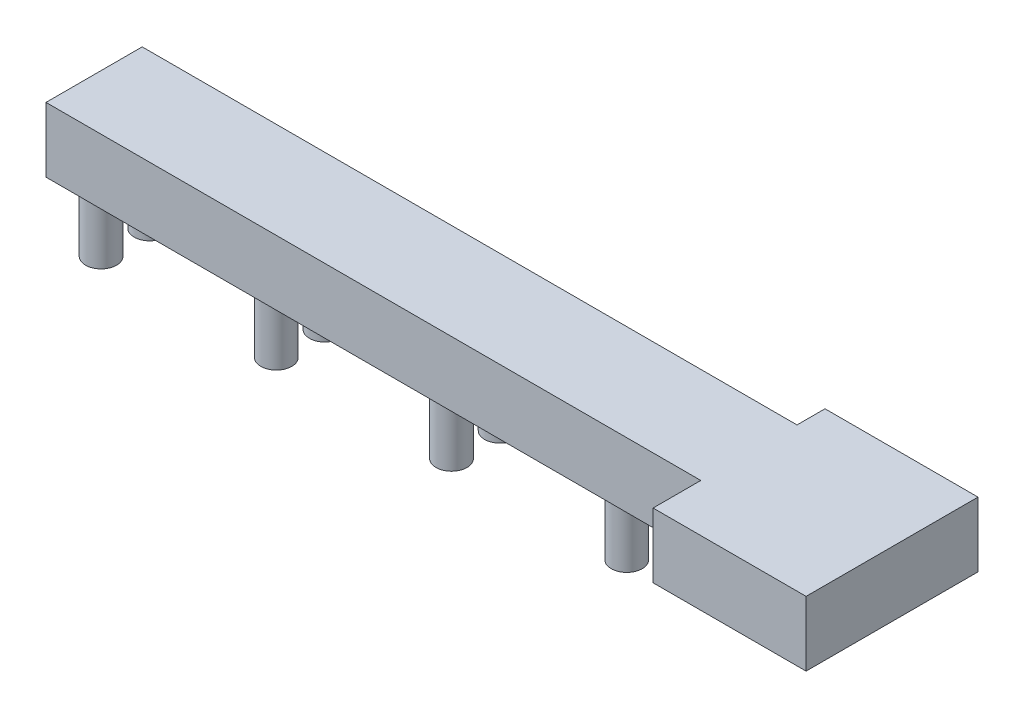
ISO-10303-21;
HEADER;
FILE_DESCRIPTION(('STEP AP214'),'2;1');
FILE_NAME('part.step','',(''),(''),'','','');
FILE_SCHEMA(('AUTOMOTIVE_DESIGN { 1 0 10303 214 1 1 1 1 }'));
ENDSEC;
DATA;
#1=APPLICATION_CONTEXT('core data for automotive mechanical design processes');
#2=APPLICATION_PROTOCOL_DEFINITION('international standard','automotive_design',2000,#1);
#3=PRODUCT_CONTEXT('',#1,'mechanical');
#4=PRODUCT('Part','Part','',(#3));
#5=PRODUCT_RELATED_PRODUCT_CATEGORY('part','',(#4));
#6=PRODUCT_DEFINITION_FORMATION('','',#4);
#7=PRODUCT_DEFINITION_CONTEXT('part definition',#1,'design');
#8=PRODUCT_DEFINITION('design','',#6,#7);
#9=PRODUCT_DEFINITION_SHAPE('','',#8);
#10=(LENGTH_UNIT() NAMED_UNIT(*) SI_UNIT(.MILLI.,.METRE.));
#11=(NAMED_UNIT(*) PLANE_ANGLE_UNIT() SI_UNIT($,.RADIAN.));
#12=(NAMED_UNIT(*) SI_UNIT($,.STERADIAN.) SOLID_ANGLE_UNIT());
#13=UNCERTAINTY_MEASURE_WITH_UNIT(LENGTH_MEASURE(1.E-05),#10,'distance_accuracy_value','');
#14=(GEOMETRIC_REPRESENTATION_CONTEXT(3) GLOBAL_UNCERTAINTY_ASSIGNED_CONTEXT((#13)) GLOBAL_UNIT_ASSIGNED_CONTEXT((#10,
#11,#12)) REPRESENTATION_CONTEXT('',''));
#15=CARTESIAN_POINT('',(0.,0.,0.));
#16=DIRECTION('',(0.,0.,1.));
#17=DIRECTION('',(1.,0.,0.));
#18=AXIS2_PLACEMENT_3D('',#15,#16,#17);
#19=CARTESIAN_POINT('',(12.3863090129927,10.,7.35));
#20=DIRECTION('',(0.,0.,-1.));
#21=DIRECTION('',(-1.,0.,0.));
#22=AXIS2_PLACEMENT_3D('',#19,#20,#21);
#23=PLANE('',#22);
#24=DIRECTION('',(1.,0.,0.));
#25=VECTOR('',#24,1.);
#26=CARTESIAN_POINT('',(12.3863090129927,0.,7.35));
#27=LINE('',#26,#25);
#28=CARTESIAN_POINT('',(-88.7036909870073,0.,7.35));
#29=VERTEX_POINT('',#28);
#30=CARTESIAN_POINT('',(12.3863090129927,0.,7.35));
#31=VERTEX_POINT('',#30);
#32=EDGE_CURVE('E134',#29,#31,#27,.T.);
#33=ORIENTED_EDGE('',*,*,#32,.T.);
#34=DIRECTION('',(0.,-1.,0.));
#35=VECTOR('',#34,1.);
#36=CARTESIAN_POINT('',(12.3863090129927,10.,7.35));
#37=LINE('',#36,#35);
#38=CARTESIAN_POINT('',(12.3863090129927,10.,7.35));
#39=VERTEX_POINT('',#38);
#40=EDGE_CURVE('E159',#39,#31,#37,.T.);
#41=ORIENTED_EDGE('',*,*,#40,.F.);
#42=DIRECTION('',(1.,0.,0.));
#43=VECTOR('',#42,1.);
#44=CARTESIAN_POINT('',(12.3863090129927,10.,7.35));
#45=LINE('',#44,#43);
#46=CARTESIAN_POINT('',(-88.7036909870073,10.,7.35));
#47=VERTEX_POINT('',#46);
#48=EDGE_CURVE('E94',#47,#39,#45,.T.);
#49=ORIENTED_EDGE('',*,*,#48,.F.);
#50=DIRECTION('',(0.,-1.,0.));
#51=VECTOR('',#50,1.);
#52=CARTESIAN_POINT('',(-88.7036909870073,10.,7.35));
#53=LINE('',#52,#51);
#54=EDGE_CURVE('E162',#47,#29,#53,.T.);
#55=ORIENTED_EDGE('',*,*,#54,.T.);
#56=EDGE_LOOP('',(#33,#41,#49,#55));
#57=FACE_BOUND('',#56,.T.);
#58=ADVANCED_FACE('F34',(#57),#23,.F.);
#59=CARTESIAN_POINT('',(12.3863090129927,10.,14.72));
#60=DIRECTION('',(1.,0.,0.));
#61=DIRECTION('',(0.,0.,-1.));
#62=AXIS2_PLACEMENT_3D('',#59,#60,#61);
#63=PLANE('',#62);
#64=DIRECTION('',(0.,0.,1.));
#65=VECTOR('',#64,1.);
#66=CARTESIAN_POINT('',(12.3863090129927,0.,14.72));
#67=LINE('',#66,#65);
#68=CARTESIAN_POINT('',(12.3863090129927,0.,14.72));
#69=VERTEX_POINT('',#68);
#70=EDGE_CURVE('E136',#31,#69,#67,.T.);
#71=ORIENTED_EDGE('',*,*,#70,.T.);
#72=DIRECTION('',(0.,-1.,0.));
#73=VECTOR('',#72,1.);
#74=CARTESIAN_POINT('',(12.3863090129927,10.,14.72));
#75=LINE('',#74,#73);
#76=CARTESIAN_POINT('',(12.3863090129927,10.,14.72));
#77=VERTEX_POINT('',#76);
#78=EDGE_CURVE('E156',#77,#69,#75,.T.);
#79=ORIENTED_EDGE('',*,*,#78,.F.);
#80=DIRECTION('',(0.,0.,1.));
#81=VECTOR('',#80,1.);
#82=CARTESIAN_POINT('',(12.3863090129927,10.,14.72));
#83=LINE('',#82,#81);
#84=EDGE_CURVE('E414',#39,#77,#83,.T.);
#85=ORIENTED_EDGE('',*,*,#84,.F.);
#86=ORIENTED_EDGE('',*,*,#40,.T.);
#87=EDGE_LOOP('',(#71,#79,#85,#86));
#88=FACE_BOUND('',#87,.T.);
#89=ADVANCED_FACE('F204',(#88),#63,.F.);
#90=CARTESIAN_POINT('',(36.0063090129927,10.,14.72));
#91=DIRECTION('',(0.,0.,-1.));
#92=DIRECTION('',(-1.,0.,0.));
#93=AXIS2_PLACEMENT_3D('',#90,#91,#92);
#94=PLANE('',#93);
#95=DIRECTION('',(1.,0.,0.));
#96=VECTOR('',#95,1.);
#97=CARTESIAN_POINT('',(36.0063090129927,0.,14.72));
#98=LINE('',#97,#96);
#99=CARTESIAN_POINT('',(36.0063090129927,0.,14.72));
#100=VERTEX_POINT('',#99);
#101=EDGE_CURVE('E139',#69,#100,#98,.T.);
#102=ORIENTED_EDGE('',*,*,#101,.T.);
#103=DIRECTION('',(0.,-1.,0.));
#104=VECTOR('',#103,1.);
#105=CARTESIAN_POINT('',(36.0063090129927,10.,14.72));
#106=LINE('',#105,#104);
#107=CARTESIAN_POINT('',(36.0063090129927,10.,14.72));
#108=VERTEX_POINT('',#107);
#109=EDGE_CURVE('E153',#108,#100,#106,.T.);
#110=ORIENTED_EDGE('',*,*,#109,.F.);
#111=DIRECTION('',(1.,0.,0.));
#112=VECTOR('',#111,1.);
#113=CARTESIAN_POINT('',(36.0063090129927,10.,14.72));
#114=LINE('',#113,#112);
#115=EDGE_CURVE('E415',#77,#108,#114,.T.);
#116=ORIENTED_EDGE('',*,*,#115,.F.);
#117=ORIENTED_EDGE('',*,*,#78,.T.);
#118=EDGE_LOOP('',(#102,#110,#116,#117));
#119=FACE_BOUND('',#118,.T.);
#120=ADVANCED_FACE('F209',(#119),#94,.F.);
#121=CARTESIAN_POINT('',(36.0063090129927,10.,-11.82));
#122=DIRECTION('',(-1.,0.,0.));
#123=DIRECTION('',(0.,0.,1.));
#124=AXIS2_PLACEMENT_3D('',#121,#122,#123);
#125=PLANE('',#124);
#126=DIRECTION('',(0.,0.,-1.));
#127=VECTOR('',#126,1.);
#128=CARTESIAN_POINT('',(36.0063090129927,0.,-11.82));
#129=LINE('',#128,#127);
#130=CARTESIAN_POINT('',(36.0063090129927,0.,-11.82));
#131=VERTEX_POINT('',#130);
#132=EDGE_CURVE('E141',#100,#131,#129,.T.);
#133=ORIENTED_EDGE('',*,*,#132,.T.);
#134=DIRECTION('',(0.,-1.,0.));
#135=VECTOR('',#134,1.);
#136=CARTESIAN_POINT('',(36.0063090129927,10.,-11.82));
#137=LINE('',#136,#135);
#138=CARTESIAN_POINT('',(36.0063090129927,10.,-11.82));
#139=VERTEX_POINT('',#138);
#140=EDGE_CURVE('E125',#139,#131,#137,.T.);
#141=ORIENTED_EDGE('',*,*,#140,.F.);
#142=DIRECTION('',(0.,0.,-1.));
#143=VECTOR('',#142,1.);
#144=CARTESIAN_POINT('',(36.0063090129927,10.,-11.82));
#145=LINE('',#144,#143);
#146=EDGE_CURVE('E114',#108,#139,#145,.T.);
#147=ORIENTED_EDGE('',*,*,#146,.F.);
#148=ORIENTED_EDGE('',*,*,#109,.T.);
#149=EDGE_LOOP('',(#133,#141,#147,#148));
#150=FACE_BOUND('',#149,.T.);
#151=ADVANCED_FACE('F373',(#150),#125,.F.);
#152=CARTESIAN_POINT('',(12.3863090129927,10.,-11.82));
#153=DIRECTION('',(0.,0.,1.));
#154=DIRECTION('',(1.,0.,0.));
#155=AXIS2_PLACEMENT_3D('',#152,#153,#154);
#156=PLANE('',#155);
#157=DIRECTION('',(-1.,0.,0.));
#158=VECTOR('',#157,1.);
#159=CARTESIAN_POINT('',(12.3863090129927,0.,-11.82));
#160=LINE('',#159,#158);
#161=CARTESIAN_POINT('',(12.3863090129927,0.,-11.82));
#162=VERTEX_POINT('',#161);
#163=EDGE_CURVE('E123',#131,#162,#160,.T.);
#164=ORIENTED_EDGE('',*,*,#163,.T.);
#165=DIRECTION('',(0.,-1.,0.));
#166=VECTOR('',#165,1.);
#167=CARTESIAN_POINT('',(12.3863090129927,10.,-11.82));
#168=LINE('',#167,#166);
#169=CARTESIAN_POINT('',(12.3863090129927,10.,-11.82));
#170=VERTEX_POINT('',#169);
#171=EDGE_CURVE('E120',#170,#162,#168,.T.);
#172=ORIENTED_EDGE('',*,*,#171,.F.);
#173=DIRECTION('',(-1.,0.,0.));
#174=VECTOR('',#173,1.);
#175=CARTESIAN_POINT('',(12.3863090129927,10.,-11.82));
#176=LINE('',#175,#174);
#177=EDGE_CURVE('E107',#139,#170,#176,.T.);
#178=ORIENTED_EDGE('',*,*,#177,.F.);
#179=ORIENTED_EDGE('',*,*,#140,.T.);
#180=EDGE_LOOP('',(#164,#172,#178,#179));
#181=FACE_BOUND('',#180,.T.);
#182=ADVANCED_FACE('F121',(#181),#156,.F.);
#183=CARTESIAN_POINT('',(12.3863090129927,10.,-7.5));
#184=DIRECTION('',(1.,0.,0.));
#185=DIRECTION('',(0.,0.,-1.));
#186=AXIS2_PLACEMENT_3D('',#183,#184,#185);
#187=PLANE('',#186);
#188=DIRECTION('',(0.,0.,1.));
#189=VECTOR('',#188,1.);
#190=CARTESIAN_POINT('',(12.3863090129927,0.,-7.5));
#191=LINE('',#190,#189);
#192=CARTESIAN_POINT('',(12.3863090129927,0.,-7.5));
#193=VERTEX_POINT('',#192);
#194=EDGE_CURVE('E144',#162,#193,#191,.T.);
#195=ORIENTED_EDGE('',*,*,#194,.T.);
#196=DIRECTION('',(0.,-1.,0.));
#197=VECTOR('',#196,1.);
#198=CARTESIAN_POINT('',(12.3863090129927,10.,-7.5));
#199=LINE('',#198,#197);
#200=CARTESIAN_POINT('',(12.3863090129927,10.,-7.5));
#201=VERTEX_POINT('',#200);
#202=EDGE_CURVE('E126',#201,#193,#199,.T.);
#203=ORIENTED_EDGE('',*,*,#202,.F.);
#204=DIRECTION('',(0.,0.,1.));
#205=VECTOR('',#204,1.);
#206=CARTESIAN_POINT('',(12.3863090129927,10.,-7.5));
#207=LINE('',#206,#205);
#208=EDGE_CURVE('E111',#170,#201,#207,.T.);
#209=ORIENTED_EDGE('',*,*,#208,.F.);
#210=ORIENTED_EDGE('',*,*,#171,.T.);
#211=EDGE_LOOP('',(#195,#203,#209,#210));
#212=FACE_BOUND('',#211,.T.);
#213=ADVANCED_FACE('F128',(#212),#187,.F.);
#214=CARTESIAN_POINT('',(-88.7036909870073,10.,-7.5));
#215=DIRECTION('',(0.,0.,1.));
#216=DIRECTION('',(1.,0.,0.));
#217=AXIS2_PLACEMENT_3D('',#214,#215,#216);
#218=PLANE('',#217);
#219=DIRECTION('',(-1.,0.,0.));
#220=VECTOR('',#219,1.);
#221=CARTESIAN_POINT('',(-88.7036909870073,0.,-7.5));
#222=LINE('',#221,#220);
#223=CARTESIAN_POINT('',(-88.7036909870073,0.,-7.5));
#224=VERTEX_POINT('',#223);
#225=EDGE_CURVE('E80',#193,#224,#222,.T.);
#226=ORIENTED_EDGE('',*,*,#225,.T.);
#227=DIRECTION('',(0.,-1.,0.));
#228=VECTOR('',#227,1.);
#229=CARTESIAN_POINT('',(-88.7036909870073,10.,-7.5));
#230=LINE('',#229,#228);
#231=CARTESIAN_POINT('',(-88.7036909870073,10.,-7.5));
#232=VERTEX_POINT('',#231);
#233=EDGE_CURVE('E130',#232,#224,#230,.T.);
#234=ORIENTED_EDGE('',*,*,#233,.F.);
#235=DIRECTION('',(-1.,0.,0.));
#236=VECTOR('',#235,1.);
#237=CARTESIAN_POINT('',(-2.7236909870073,10.,-7.5));
#238=LINE('',#237,#236);
#239=EDGE_CURVE('E51',#201,#232,#238,.T.);
#240=ORIENTED_EDGE('',*,*,#239,.F.);
#241=ORIENTED_EDGE('',*,*,#202,.T.);
#242=EDGE_LOOP('',(#226,#234,#240,#241));
#243=FACE_BOUND('',#242,.T.);
#244=ADVANCED_FACE('F345',(#243),#218,.F.);
#245=CARTESIAN_POINT('',(-88.7036909870073,10.,0.));
#246=DIRECTION('',(1.,0.,0.));
#247=DIRECTION('',(0.,0.,-1.));
#248=AXIS2_PLACEMENT_3D('',#245,#246,#247);
#249=PLANE('',#248);
#250=DIRECTION('',(0.,0.,1.));
#251=VECTOR('',#250,1.);
#252=CARTESIAN_POINT('',(-88.7036909870073,0.,0.));
#253=LINE('',#252,#251);
#254=EDGE_CURVE('E147',#224,#29,#253,.T.);
#255=ORIENTED_EDGE('',*,*,#254,.T.);
#256=ORIENTED_EDGE('',*,*,#54,.F.);
#257=DIRECTION('',(0.,0.,1.));
#258=VECTOR('',#257,1.);
#259=CARTESIAN_POINT('',(-88.7036909870073,10.,7.35));
#260=LINE('',#259,#258);
#261=EDGE_CURVE('E149',#232,#47,#260,.T.);
#262=ORIENTED_EDGE('',*,*,#261,.F.);
#263=ORIENTED_EDGE('',*,*,#233,.T.);
#264=EDGE_LOOP('',(#255,#256,#262,#263));
#265=FACE_BOUND('',#264,.T.);
#266=ADVANCED_FACE('F198',(#265),#249,.F.);
#267=CARTESIAN_POINT('',(0.,10.,0.));
#268=DIRECTION('',(0.,-1.,0.));
#269=DIRECTION('',(0.,0.,-1.));
#270=AXIS2_PLACEMENT_3D('',#267,#268,#269);
#271=PLANE('',#270);
#272=ORIENTED_EDGE('',*,*,#261,.T.);
#273=ORIENTED_EDGE('',*,*,#48,.T.);
#274=ORIENTED_EDGE('',*,*,#84,.T.);
#275=ORIENTED_EDGE('',*,*,#115,.T.);
#276=ORIENTED_EDGE('',*,*,#146,.T.);
#277=ORIENTED_EDGE('',*,*,#177,.T.);
#278=ORIENTED_EDGE('',*,*,#208,.T.);
#279=ORIENTED_EDGE('',*,*,#239,.T.);
#280=EDGE_LOOP('',(#272,#273,#274,#275,#276,#277,#278,#279));
#281=FACE_BOUND('',#280,.T.);
#282=ADVANCED_FACE('F109',(#281),#271,.F.);
#283=CARTESIAN_POINT('',(0.,0.,0.));
#284=DIRECTION('',(0.,-1.,0.));
#285=DIRECTION('',(0.,0.,-1.));
#286=AXIS2_PLACEMENT_3D('',#283,#284,#285);
#287=PLANE('',#286);
#288=CARTESIAN_POINT('',(-56.8236909870073,0.,-3.825));
#289=DIRECTION('',(0.,-1.,0.));
#290=DIRECTION('',(0.,0.,-1.));
#291=AXIS2_PLACEMENT_3D('',#288,#289,#290);
#292=CIRCLE('',#291,2.39);
#293=CARTESIAN_POINT('',(-56.8236909870073,0.,-6.215));
#294=VERTEX_POINT('',#293);
#295=EDGE_CURVE('E441',#294,#294,#292,.T.);
#296=ORIENTED_EDGE('',*,*,#295,.F.);
#297=EDGE_LOOP('',(#296));
#298=FACE_BOUND('',#297,.T.);
#299=CARTESIAN_POINT('',(-56.8236909870073,0.,3.675));
#300=DIRECTION('',(0.,-1.,0.));
#301=DIRECTION('',(0.,0.,-1.));
#302=AXIS2_PLACEMENT_3D('',#299,#300,#301);
#303=CIRCLE('',#302,2.39294525089885);
#304=CARTESIAN_POINT('',(-56.8236909870073,0.,1.28205474910115));
#305=VERTEX_POINT('',#304);
#306=EDGE_CURVE('E435',#305,#305,#303,.T.);
#307=ORIENTED_EDGE('',*,*,#306,.F.);
#308=EDGE_LOOP('',(#307));
#309=FACE_BOUND('',#308,.T.);
#310=CARTESIAN_POINT('',(-83.8736909870073,0.,3.675));
#311=DIRECTION('',(0.,-1.,0.));
#312=DIRECTION('',(0.,0.,-1.));
#313=AXIS2_PLACEMENT_3D('',#310,#311,#312);
#314=CIRCLE('',#313,2.39294525089885);
#315=CARTESIAN_POINT('',(-83.8736909870073,0.,1.28205474910115));
#316=VERTEX_POINT('',#315);
#317=EDGE_CURVE('E427',#316,#316,#314,.T.);
#318=ORIENTED_EDGE('',*,*,#317,.F.);
#319=EDGE_LOOP('',(#318));
#320=FACE_BOUND('',#319,.T.);
#321=CARTESIAN_POINT('',(-83.8736909870073,0.,-3.825));
#322=DIRECTION('',(0.,-1.,0.));
#323=DIRECTION('',(0.,0.,-1.));
#324=AXIS2_PLACEMENT_3D('',#321,#322,#323);
#325=CIRCLE('',#324,2.39);
#326=CARTESIAN_POINT('',(-83.8736909870073,0.,-6.215));
#327=VERTEX_POINT('',#326);
#328=EDGE_CURVE('E421',#327,#327,#325,.T.);
#329=ORIENTED_EDGE('',*,*,#328,.F.);
#330=EDGE_LOOP('',(#329));
#331=FACE_BOUND('',#330,.T.);
#332=ORIENTED_EDGE('',*,*,#32,.F.);
#333=ORIENTED_EDGE('',*,*,#254,.F.);
#334=ORIENTED_EDGE('',*,*,#225,.F.);
#335=ORIENTED_EDGE('',*,*,#194,.F.);
#336=ORIENTED_EDGE('',*,*,#163,.F.);
#337=ORIENTED_EDGE('',*,*,#132,.F.);
#338=ORIENTED_EDGE('',*,*,#101,.F.);
#339=ORIENTED_EDGE('',*,*,#70,.F.);
#340=EDGE_LOOP('',(#332,#333,#334,#335,#336,#337,#338,#339));
#341=FACE_BOUND('',#340,.T.);
#342=CARTESIAN_POINT('',(-29.7736909870073,0.,3.675));
#343=DIRECTION('',(0.,-1.,0.));
#344=DIRECTION('',(0.,0.,-1.));
#345=AXIS2_PLACEMENT_3D('',#342,#343,#344);
#346=CIRCLE('',#345,2.39294525089885);
#347=CARTESIAN_POINT('',(-29.7736909870073,0.,1.28205474910115));
#348=VERTEX_POINT('',#347);
#349=EDGE_CURVE('E164',#348,#348,#346,.T.);
#350=ORIENTED_EDGE('',*,*,#349,.F.);
#351=EDGE_LOOP('',(#350));
#352=FACE_BOUND('',#351,.T.);
#353=CARTESIAN_POINT('',(-2.72369098700731,0.,3.675));
#354=DIRECTION('',(0.,-1.,0.));
#355=DIRECTION('',(0.,0.,-1.));
#356=AXIS2_PLACEMENT_3D('',#353,#354,#355);
#357=CIRCLE('',#356,2.39294525089885);
#358=CARTESIAN_POINT('',(-2.72369098700731,0.,1.28205474910115));
#359=VERTEX_POINT('',#358);
#360=EDGE_CURVE('E170',#359,#359,#357,.T.);
#361=ORIENTED_EDGE('',*,*,#360,.F.);
#362=EDGE_LOOP('',(#361));
#363=FACE_BOUND('',#362,.T.);
#364=CARTESIAN_POINT('',(-29.7736909870073,0.,-3.825));
#365=DIRECTION('',(0.,-1.,0.));
#366=DIRECTION('',(0.,0.,-1.));
#367=AXIS2_PLACEMENT_3D('',#364,#365,#366);
#368=CIRCLE('',#367,2.39);
#369=CARTESIAN_POINT('',(-29.7736909870073,0.,-6.215));
#370=VERTEX_POINT('',#369);
#371=EDGE_CURVE('E176',#370,#370,#368,.T.);
#372=ORIENTED_EDGE('',*,*,#371,.F.);
#373=EDGE_LOOP('',(#372));
#374=FACE_BOUND('',#373,.T.);
#375=CARTESIAN_POINT('',(-2.72369098700731,0.,-3.825));
#376=DIRECTION('',(0.,-1.,0.));
#377=DIRECTION('',(0.,0.,-1.));
#378=AXIS2_PLACEMENT_3D('',#375,#376,#377);
#379=CIRCLE('',#378,2.39);
#380=CARTESIAN_POINT('',(-2.72369098700731,0.,-6.215));
#381=VERTEX_POINT('',#380);
#382=EDGE_CURVE('E43',#381,#381,#379,.T.);
#383=ORIENTED_EDGE('',*,*,#382,.F.);
#384=EDGE_LOOP('',(#383));
#385=FACE_BOUND('',#384,.T.);
#386=ADVANCED_FACE('F186',(#298,#309,#320,#331,#341,#352,#363,#374,#385),#287,.T.);
#387=CARTESIAN_POINT('',(-83.8736909870073,-10.,-3.825));
#388=DIRECTION('',(0.,1.,0.));
#389=DIRECTION('',(0.,0.,1.));
#390=AXIS2_PLACEMENT_3D('',#387,#388,#389);
#391=CYLINDRICAL_SURFACE('',#390,2.39);
#392=CARTESIAN_POINT('',(-83.8736909870073,-10.,-3.825));
#393=DIRECTION('',(0.,-1.,0.));
#394=DIRECTION('',(0.,0.,-1.));
#395=AXIS2_PLACEMENT_3D('',#392,#393,#394);
#396=CIRCLE('',#395,2.39);
#397=CARTESIAN_POINT('',(-83.8736909870073,-10.,-6.215));
#398=VERTEX_POINT('',#397);
#399=EDGE_CURVE('E137',#398,#398,#396,.T.);
#400=ORIENTED_EDGE('',*,*,#399,.F.);
#401=EDGE_LOOP('',(#400));
#402=FACE_BOUND('',#401,.T.);
#403=ORIENTED_EDGE('',*,*,#328,.T.);
#404=EDGE_LOOP('',(#403));
#405=FACE_BOUND('',#404,.T.);
#406=ADVANCED_FACE('F188',(#402,#405),#391,.T.);
#407=CARTESIAN_POINT('',(-83.8736909870073,-10.,-3.825));
#408=DIRECTION('',(0.,-1.,0.));
#409=DIRECTION('',(0.,0.,-1.));
#410=AXIS2_PLACEMENT_3D('',#407,#408,#409);
#411=PLANE('',#410);
#412=ORIENTED_EDGE('',*,*,#399,.T.);
#413=EDGE_LOOP('',(#412));
#414=FACE_BOUND('',#413,.T.);
#415=ADVANCED_FACE('F195',(#414),#411,.T.);
#416=CARTESIAN_POINT('',(-83.8736909870073,-10.,3.675));
#417=DIRECTION('',(0.,1.,0.));
#418=DIRECTION('',(0.,0.,1.));
#419=AXIS2_PLACEMENT_3D('',#416,#417,#418);
#420=CYLINDRICAL_SURFACE('',#419,2.39294525089885);
#421=CARTESIAN_POINT('',(-83.8736909870073,-10.,3.675));
#422=DIRECTION('',(0.,-1.,0.));
#423=DIRECTION('',(0.,0.,-1.));
#424=AXIS2_PLACEMENT_3D('',#421,#422,#423);
#425=CIRCLE('',#424,2.39294525089885);
#426=CARTESIAN_POINT('',(-83.8736909870073,-10.,1.28205474910115));
#427=VERTEX_POINT('',#426);
#428=EDGE_CURVE('E424',#427,#427,#425,.T.);
#429=ORIENTED_EDGE('',*,*,#428,.F.);
#430=EDGE_LOOP('',(#429));
#431=FACE_BOUND('',#430,.T.);
#432=ORIENTED_EDGE('',*,*,#317,.T.);
#433=EDGE_LOOP('',(#432));
#434=FACE_BOUND('',#433,.T.);
#435=ADVANCED_FACE('F309',(#431,#434),#420,.T.);
#436=CARTESIAN_POINT('',(-83.8736909870073,-10.,3.675));
#437=DIRECTION('',(0.,-1.,0.));
#438=DIRECTION('',(0.,0.,-1.));
#439=AXIS2_PLACEMENT_3D('',#436,#437,#438);
#440=PLANE('',#439);
#441=ORIENTED_EDGE('',*,*,#428,.T.);
#442=EDGE_LOOP('',(#441));
#443=FACE_BOUND('',#442,.T.);
#444=ADVANCED_FACE('F301',(#443),#440,.T.);
#445=CARTESIAN_POINT('',(-56.8236909870073,-10.,3.675));
#446=DIRECTION('',(0.,1.,0.));
#447=DIRECTION('',(0.,0.,1.));
#448=AXIS2_PLACEMENT_3D('',#445,#446,#447);
#449=CYLINDRICAL_SURFACE('',#448,2.39294525089885);
#450=CARTESIAN_POINT('',(-56.8236909870073,-10.,3.675));
#451=DIRECTION('',(0.,-1.,0.));
#452=DIRECTION('',(0.,0.,-1.));
#453=AXIS2_PLACEMENT_3D('',#450,#451,#452);
#454=CIRCLE('',#453,2.39294525089885);
#455=CARTESIAN_POINT('',(-56.8236909870073,-10.,1.28205474910115));
#456=VERTEX_POINT('',#455);
#457=EDGE_CURVE('E430',#456,#456,#454,.T.);
#458=ORIENTED_EDGE('',*,*,#457,.F.);
#459=EDGE_LOOP('',(#458));
#460=FACE_BOUND('',#459,.T.);
#461=ORIENTED_EDGE('',*,*,#306,.T.);
#462=EDGE_LOOP('',(#461));
#463=FACE_BOUND('',#462,.T.);
#464=ADVANCED_FACE('F293',(#460,#463),#449,.T.);
#465=CARTESIAN_POINT('',(-56.8236909870073,-10.,3.675));
#466=DIRECTION('',(0.,-1.,0.));
#467=DIRECTION('',(0.,0.,-1.));
#468=AXIS2_PLACEMENT_3D('',#465,#466,#467);
#469=PLANE('',#468);
#470=ORIENTED_EDGE('',*,*,#457,.T.);
#471=EDGE_LOOP('',(#470));
#472=FACE_BOUND('',#471,.T.);
#473=ADVANCED_FACE('F222',(#472),#469,.T.);
#474=CARTESIAN_POINT('',(-29.7736909870073,-10.,3.675));
#475=DIRECTION('',(0.,-1.,0.));
#476=DIRECTION('',(0.,0.,-1.));
#477=AXIS2_PLACEMENT_3D('',#474,#475,#476);
#478=PLANE('',#477);
#479=CARTESIAN_POINT('',(-29.7736909870073,-10.,3.675));
#480=DIRECTION('',(0.,-1.,0.));
#481=DIRECTION('',(0.,0.,-1.));
#482=AXIS2_PLACEMENT_3D('',#479,#480,#481);
#483=CIRCLE('',#482,2.39294525089885);
#484=CARTESIAN_POINT('',(-29.7736909870073,-10.,1.28205474910115));
#485=VERTEX_POINT('',#484);
#486=EDGE_CURVE('E167',#485,#485,#483,.T.);
#487=ORIENTED_EDGE('',*,*,#486,.T.);
#488=EDGE_LOOP('',(#487));
#489=FACE_BOUND('',#488,.T.);
#490=ADVANCED_FACE('F218',(#489),#478,.T.);
#491=CARTESIAN_POINT('',(-29.7736909870073,-10.,3.675));
#492=DIRECTION('',(0.,1.,0.));
#493=DIRECTION('',(0.,0.,1.));
#494=AXIS2_PLACEMENT_3D('',#491,#492,#493);
#495=CYLINDRICAL_SURFACE('',#494,2.39294525089885);
#496=ORIENTED_EDGE('',*,*,#486,.F.);
#497=EDGE_LOOP('',(#496));
#498=FACE_BOUND('',#497,.T.);
#499=ORIENTED_EDGE('',*,*,#349,.T.);
#500=EDGE_LOOP('',(#499));
#501=FACE_BOUND('',#500,.T.);
#502=ADVANCED_FACE('F214',(#498,#501),#495,.T.);
#503=CARTESIAN_POINT('',(-2.72369098700731,-10.,3.675));
#504=DIRECTION('',(0.,-1.,0.));
#505=DIRECTION('',(0.,0.,-1.));
#506=AXIS2_PLACEMENT_3D('',#503,#504,#505);
#507=PLANE('',#506);
#508=CARTESIAN_POINT('',(-2.72369098700731,-10.,3.675));
#509=DIRECTION('',(0.,-1.,0.));
#510=DIRECTION('',(0.,0.,-1.));
#511=AXIS2_PLACEMENT_3D('',#508,#509,#510);
#512=CIRCLE('',#511,2.39294525089885);
#513=CARTESIAN_POINT('',(-2.72369098700731,-10.,1.28205474910115));
#514=VERTEX_POINT('',#513);
#515=EDGE_CURVE('E173',#514,#514,#512,.T.);
#516=ORIENTED_EDGE('',*,*,#515,.T.);
#517=EDGE_LOOP('',(#516));
#518=FACE_BOUND('',#517,.T.);
#519=ADVANCED_FACE('F217',(#518),#507,.T.);
#520=CARTESIAN_POINT('',(-2.72369098700731,-10.,3.675));
#521=DIRECTION('',(0.,1.,0.));
#522=DIRECTION('',(0.,0.,1.));
#523=AXIS2_PLACEMENT_3D('',#520,#521,#522);
#524=CYLINDRICAL_SURFACE('',#523,2.39294525089885);
#525=ORIENTED_EDGE('',*,*,#515,.F.);
#526=EDGE_LOOP('',(#525));
#527=FACE_BOUND('',#526,.T.);
#528=ORIENTED_EDGE('',*,*,#360,.T.);
#529=EDGE_LOOP('',(#528));
#530=FACE_BOUND('',#529,.T.);
#531=ADVANCED_FACE('F224',(#527,#530),#524,.T.);
#532=CARTESIAN_POINT('',(-56.8236909870073,-10.,-3.825));
#533=DIRECTION('',(0.,1.,0.));
#534=DIRECTION('',(0.,0.,1.));
#535=AXIS2_PLACEMENT_3D('',#532,#533,#534);
#536=CYLINDRICAL_SURFACE('',#535,2.39);
#537=CARTESIAN_POINT('',(-56.8236909870073,-10.,-3.825));
#538=DIRECTION('',(0.,-1.,0.));
#539=DIRECTION('',(0.,0.,-1.));
#540=AXIS2_PLACEMENT_3D('',#537,#538,#539);
#541=CIRCLE('',#540,2.39);
#542=CARTESIAN_POINT('',(-56.8236909870073,-10.,-6.215));
#543=VERTEX_POINT('',#542);
#544=EDGE_CURVE('E438',#543,#543,#541,.T.);
#545=ORIENTED_EDGE('',*,*,#544,.F.);
#546=EDGE_LOOP('',(#545));
#547=FACE_BOUND('',#546,.T.);
#548=ORIENTED_EDGE('',*,*,#295,.T.);
#549=EDGE_LOOP('',(#548));
#550=FACE_BOUND('',#549,.T.);
#551=ADVANCED_FACE('F227',(#547,#550),#536,.T.);
#552=CARTESIAN_POINT('',(-56.8236909870073,-10.,-3.825));
#553=DIRECTION('',(0.,-1.,0.));
#554=DIRECTION('',(0.,0.,-1.));
#555=AXIS2_PLACEMENT_3D('',#552,#553,#554);
#556=PLANE('',#555);
#557=ORIENTED_EDGE('',*,*,#544,.T.);
#558=EDGE_LOOP('',(#557));
#559=FACE_BOUND('',#558,.T.);
#560=ADVANCED_FACE('F238',(#559),#556,.T.);
#561=CARTESIAN_POINT('',(-29.7736909870073,-10.,-3.825));
#562=DIRECTION('',(0.,-1.,0.));
#563=DIRECTION('',(0.,0.,-1.));
#564=AXIS2_PLACEMENT_3D('',#561,#562,#563);
#565=PLANE('',#564);
#566=CARTESIAN_POINT('',(-29.7736909870073,-10.,-3.825));
#567=DIRECTION('',(0.,-1.,0.));
#568=DIRECTION('',(0.,0.,-1.));
#569=AXIS2_PLACEMENT_3D('',#566,#567,#568);
#570=CIRCLE('',#569,2.39);
#571=CARTESIAN_POINT('',(-29.7736909870073,-10.,-6.215));
#572=VERTEX_POINT('',#571);
#573=EDGE_CURVE('E179',#572,#572,#570,.T.);
#574=ORIENTED_EDGE('',*,*,#573,.T.);
#575=EDGE_LOOP('',(#574));
#576=FACE_BOUND('',#575,.T.);
#577=ADVANCED_FACE('F235',(#576),#565,.T.);
#578=CARTESIAN_POINT('',(-29.7736909870073,-10.,-3.825));
#579=DIRECTION('',(0.,1.,0.));
#580=DIRECTION('',(0.,0.,1.));
#581=AXIS2_PLACEMENT_3D('',#578,#579,#580);
#582=CYLINDRICAL_SURFACE('',#581,2.39);
#583=ORIENTED_EDGE('',*,*,#573,.F.);
#584=EDGE_LOOP('',(#583));
#585=FACE_BOUND('',#584,.T.);
#586=ORIENTED_EDGE('',*,*,#371,.T.);
#587=EDGE_LOOP('',(#586));
#588=FACE_BOUND('',#587,.T.);
#589=ADVANCED_FACE('F232',(#585,#588),#582,.T.);
#590=CARTESIAN_POINT('',(-2.72369098700731,-10.,-3.825));
#591=DIRECTION('',(0.,-1.,0.));
#592=DIRECTION('',(0.,0.,-1.));
#593=AXIS2_PLACEMENT_3D('',#590,#591,#592);
#594=PLANE('',#593);
#595=CARTESIAN_POINT('',(-2.72369098700731,-10.,-3.825));
#596=DIRECTION('',(0.,-1.,0.));
#597=DIRECTION('',(0.,0.,-1.));
#598=AXIS2_PLACEMENT_3D('',#595,#596,#597);
#599=CIRCLE('',#598,2.39);
#600=CARTESIAN_POINT('',(-2.72369098700731,-10.,-6.215));
#601=VERTEX_POINT('',#600);
#602=EDGE_CURVE('E11',#601,#601,#599,.T.);
#603=ORIENTED_EDGE('',*,*,#602,.T.);
#604=EDGE_LOOP('',(#603));
#605=FACE_BOUND('',#604,.T.);
#606=ADVANCED_FACE('F36',(#605),#594,.T.);
#607=CARTESIAN_POINT('',(-2.72369098700731,-10.,-3.825));
#608=DIRECTION('',(0.,1.,0.));
#609=DIRECTION('',(0.,0.,1.));
#610=AXIS2_PLACEMENT_3D('',#607,#608,#609);
#611=CYLINDRICAL_SURFACE('',#610,2.39);
#612=ORIENTED_EDGE('',*,*,#602,.F.);
#613=EDGE_LOOP('',(#612));
#614=FACE_BOUND('',#613,.T.);
#615=ORIENTED_EDGE('',*,*,#382,.T.);
#616=EDGE_LOOP('',(#615));
#617=FACE_BOUND('',#616,.T.);
#618=ADVANCED_FACE('F184',(#614,#617),#611,.T.);
#619=CLOSED_SHELL('',(#58,#89,#120,#151,#182,#213,#244,#266,#282,#386,#406,#415,#435,#444,#464,
#473,#490,#502,#519,#531,#551,#560,#577,#589,#606,#618));
#620=MANIFOLD_SOLID_BREP('B2',#619);
#621=ADVANCED_BREP_SHAPE_REPRESENTATION('',(#18,#620),#14);
#622=SHAPE_DEFINITION_REPRESENTATION(#9,#621);
ENDSEC;
END-ISO-10303-21;
